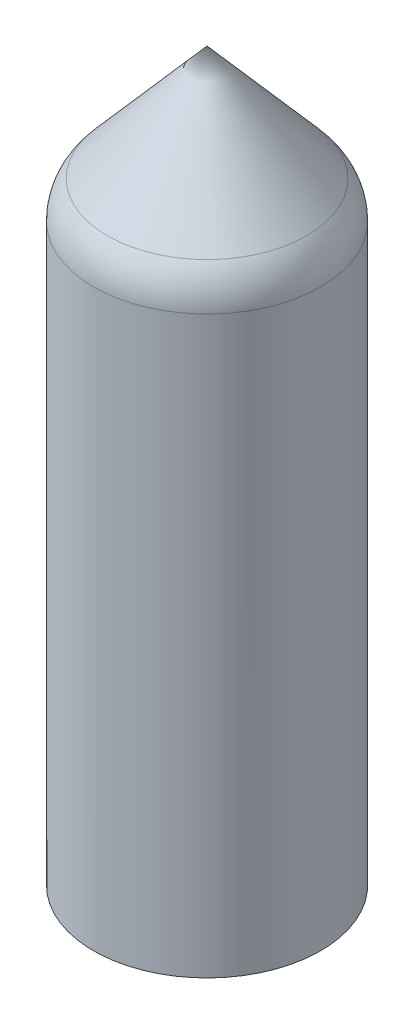
ISO-10303-21;
HEADER;
FILE_DESCRIPTION(('STEP AP214'),'2;1');
FILE_NAME('part.step','',(''),(''),'','','');
FILE_SCHEMA(('AUTOMOTIVE_DESIGN { 1 0 10303 214 1 1 1 1 }'));
ENDSEC;
DATA;
#1=APPLICATION_CONTEXT('core data for automotive mechanical design processes');
#2=APPLICATION_PROTOCOL_DEFINITION('international standard','automotive_design',2000,#1);
#3=PRODUCT_CONTEXT('',#1,'mechanical');
#4=PRODUCT('Part','Part','',(#3));
#5=PRODUCT_RELATED_PRODUCT_CATEGORY('part','',(#4));
#6=PRODUCT_DEFINITION_FORMATION('','',#4);
#7=PRODUCT_DEFINITION_CONTEXT('part definition',#1,'design');
#8=PRODUCT_DEFINITION('design','',#6,#7);
#9=PRODUCT_DEFINITION_SHAPE('','',#8);
#10=(LENGTH_UNIT() NAMED_UNIT(*) SI_UNIT(.MILLI.,.METRE.));
#11=(NAMED_UNIT(*) PLANE_ANGLE_UNIT() SI_UNIT($,.RADIAN.));
#12=(NAMED_UNIT(*) SI_UNIT($,.STERADIAN.) SOLID_ANGLE_UNIT());
#13=UNCERTAINTY_MEASURE_WITH_UNIT(LENGTH_MEASURE(1.E-05),#10,'distance_accuracy_value','');
#14=(GEOMETRIC_REPRESENTATION_CONTEXT(3) GLOBAL_UNCERTAINTY_ASSIGNED_CONTEXT((#13)) GLOBAL_UNIT_ASSIGNED_CONTEXT((#10,
#11,#12)) REPRESENTATION_CONTEXT('',''));
#15=CARTESIAN_POINT('',(0.,0.,0.));
#16=DIRECTION('',(0.,0.,1.));
#17=DIRECTION('',(1.,0.,0.));
#18=AXIS2_PLACEMENT_3D('',#15,#16,#17);
#19=CARTESIAN_POINT('',(-12.5,0.,0.));
#20=DIRECTION('',(0.,-1.,0.));
#21=DIRECTION('',(0.,0.,-1.));
#22=AXIS2_PLACEMENT_3D('',#19,#20,#21);
#23=CYLINDRICAL_SURFACE('',#22,1.65);
#24=CARTESIAN_POINT('',(-12.5,-5.,0.));
#25=DIRECTION('',(0.,-1.,0.));
#26=DIRECTION('',(0.,0.,1.));
#27=AXIS2_PLACEMENT_3D('',#24,#25,#26);
#28=CIRCLE('',#27,1.65);
#29=CARTESIAN_POINT('',(-12.5,-5.,1.65));
#30=VERTEX_POINT('',#29);
#31=EDGE_CURVE('E211',#30,#30,#28,.T.);
#32=ORIENTED_EDGE('',*,*,#31,.T.);
#33=EDGE_LOOP('',(#32));
#34=FACE_BOUND('',#33,.T.);
#35=CARTESIAN_POINT('',(-12.5,-2.,0.));
#36=DIRECTION('',(0.,1.,0.));
#37=DIRECTION('',(0.,0.,1.));
#38=AXIS2_PLACEMENT_3D('',#35,#36,#37);
#39=CIRCLE('',#38,1.65);
#40=CARTESIAN_POINT('',(-12.5,-2.,1.65));
#41=VERTEX_POINT('',#40);
#42=EDGE_CURVE('E209',#41,#41,#39,.F.);
#43=ORIENTED_EDGE('',*,*,#42,.F.);
#44=EDGE_LOOP('',(#43));
#45=FACE_BOUND('',#44,.T.);
#46=ADVANCED_FACE('F32',(#34,#45),#23,.F.);
#47=CARTESIAN_POINT('',(12.5,0.,0.));
#48=DIRECTION('',(0.,-1.,0.));
#49=DIRECTION('',(0.,0.,-1.));
#50=AXIS2_PLACEMENT_3D('',#47,#48,#49);
#51=CYLINDRICAL_SURFACE('',#50,1.65);
#52=CARTESIAN_POINT('',(12.5,-5.,0.));
#53=DIRECTION('',(0.,-1.,0.));
#54=DIRECTION('',(0.,0.,-1.));
#55=AXIS2_PLACEMENT_3D('',#52,#53,#54);
#56=CIRCLE('',#55,1.65);
#57=CARTESIAN_POINT('',(12.5,-5.,-1.65));
#58=VERTEX_POINT('',#57);
#59=EDGE_CURVE('E212',#58,#58,#56,.T.);
#60=ORIENTED_EDGE('',*,*,#59,.T.);
#61=EDGE_LOOP('',(#60));
#62=FACE_BOUND('',#61,.T.);
#63=CARTESIAN_POINT('',(12.5,-2.,0.));
#64=DIRECTION('',(0.,1.,0.));
#65=DIRECTION('',(0.,0.,1.));
#66=AXIS2_PLACEMENT_3D('',#63,#64,#65);
#67=CIRCLE('',#66,1.65);
#68=CARTESIAN_POINT('',(12.5,-2.,1.65));
#69=VERTEX_POINT('',#68);
#70=EDGE_CURVE('E171',#69,#69,#67,.F.);
#71=ORIENTED_EDGE('',*,*,#70,.F.);
#72=EDGE_LOOP('',(#71));
#73=FACE_BOUND('',#72,.T.);
#74=ADVANCED_FACE('F300',(#62,#73),#51,.F.);
#75=CARTESIAN_POINT('',(0.,100.,0.));
#76=DIRECTION('',(0.,-1.,0.));
#77=DIRECTION('',(0.,0.,-1.));
#78=AXIS2_PLACEMENT_3D('',#75,#76,#77);
#79=CONICAL_SURFACE('',#78,17.,0.704494064242218);
#80=CARTESIAN_POINT('',(0.,120.,0.));
#81=VERTEX_POINT('',#80);
#82=VERTEX_LOOP('',#81);
#83=FACE_BOUND('',#82,.T.);
#84=CARTESIAN_POINT('',(0.,100.,0.));
#85=DIRECTION('',(0.,-1.,0.));
#86=DIRECTION('',(0.,0.,-1.));
#87=AXIS2_PLACEMENT_3D('',#84,#85,#86);
#88=CIRCLE('',#87,17.);
#89=CARTESIAN_POINT('',(0.,100.,-17.));
#90=VERTEX_POINT('',#89);
#91=EDGE_CURVE('E230',#90,#90,#88,.T.);
#92=ORIENTED_EDGE('',*,*,#91,.T.);
#93=EDGE_LOOP('',(#92));
#94=FACE_BOUND('',#93,.T.);
#95=ADVANCED_FACE('F306',(#83,#94),#79,.F.);
#96=CARTESIAN_POINT('',(0.,0.,0.));
#97=DIRECTION('',(0.,-1.,0.));
#98=DIRECTION('',(0.,0.,-1.));
#99=AXIS2_PLACEMENT_3D('',#96,#97,#98);
#100=CYLINDRICAL_SURFACE('',#99,17.);
#101=ORIENTED_EDGE('',*,*,#91,.F.);
#102=EDGE_LOOP('',(#101));
#103=FACE_BOUND('',#102,.T.);
#104=CARTESIAN_POINT('',(0.,0.,0.));
#105=DIRECTION('',(0.,-1.,0.));
#106=DIRECTION('',(0.,0.,-1.));
#107=AXIS2_PLACEMENT_3D('',#104,#105,#106);
#108=CIRCLE('',#107,17.);
#109=CARTESIAN_POINT('',(0.,0.,-17.));
#110=VERTEX_POINT('',#109);
#111=EDGE_CURVE('E227',#110,#110,#108,.T.);
#112=ORIENTED_EDGE('',*,*,#111,.T.);
#113=EDGE_LOOP('',(#112));
#114=FACE_BOUND('',#113,.T.);
#115=ADVANCED_FACE('F328',(#103,#114),#100,.F.);
#116=CARTESIAN_POINT('',(-10.,0.,0.));
#117=DIRECTION('',(0.,-1.,0.));
#118=DIRECTION('',(0.,0.,-1.));
#119=AXIS2_PLACEMENT_3D('',#116,#117,#118);
#120=PLANE('',#119);
#121=ORIENTED_EDGE('',*,*,#111,.F.);
#122=EDGE_LOOP('',(#121));
#123=FACE_BOUND('',#122,.T.);
#124=DIRECTION('',(-0.866025403784439,0.,0.5));
#125=VECTOR('',#124,1.);
#126=CARTESIAN_POINT('',(-12.5,0.,-3.4));
#127=LINE('',#126,#125);
#128=CARTESIAN_POINT('',(-12.5,0.,-3.4));
#129=VERTEX_POINT('',#128);
#130=CARTESIAN_POINT('',(-15.4444863728671,0.,-1.7));
#131=VERTEX_POINT('',#130);
#132=EDGE_CURVE('E159',#129,#131,#127,.T.);
#133=ORIENTED_EDGE('',*,*,#132,.F.);
#134=DIRECTION('',(-0.866025403784439,0.,-0.5));
#135=VECTOR('',#134,1.);
#136=CARTESIAN_POINT('',(-9.55551362713291,0.,-1.7));
#137=LINE('',#136,#135);
#138=CARTESIAN_POINT('',(-9.82620068659996,0.,-1.85628124664945));
#139=VERTEX_POINT('',#138);
#140=EDGE_CURVE('E143',#139,#129,#137,.T.);
#141=ORIENTED_EDGE('',*,*,#140,.F.);
#142=CARTESIAN_POINT('',(0.,0.,0.));
#143=DIRECTION('',(0.,-1.,0.));
#144=DIRECTION('',(0.,0.,-1.));
#145=AXIS2_PLACEMENT_3D('',#142,#143,#144);
#146=CIRCLE('',#145,10.);
#147=CARTESIAN_POINT('',(9.82620068659996,0.,-1.85628124664945));
#148=VERTEX_POINT('',#147);
#149=EDGE_CURVE('E223',#139,#148,#146,.T.);
#150=ORIENTED_EDGE('',*,*,#149,.T.);
#151=DIRECTION('',(-0.866025403784439,0.,0.5));
#152=VECTOR('',#151,1.);
#153=CARTESIAN_POINT('',(12.5,0.,-3.4));
#154=LINE('',#153,#152);
#155=CARTESIAN_POINT('',(12.5,0.,-3.4));
#156=VERTEX_POINT('',#155);
#157=EDGE_CURVE('E191',#156,#148,#154,.T.);
#158=ORIENTED_EDGE('',*,*,#157,.F.);
#159=DIRECTION('',(-0.866025403784439,0.,-0.5));
#160=VECTOR('',#159,1.);
#161=CARTESIAN_POINT('',(15.4444863728671,0.,-1.7));
#162=LINE('',#161,#160);
#163=CARTESIAN_POINT('',(15.4444863728671,0.,-1.7));
#164=VERTEX_POINT('',#163);
#165=EDGE_CURVE('E188',#164,#156,#162,.T.);
#166=ORIENTED_EDGE('',*,*,#165,.F.);
#167=DIRECTION('',(0.,0.,-1.));
#168=VECTOR('',#167,1.);
#169=CARTESIAN_POINT('',(15.4444863728671,0.,1.7));
#170=LINE('',#169,#168);
#171=CARTESIAN_POINT('',(15.4444863728671,0.,1.7));
#172=VERTEX_POINT('',#171);
#173=EDGE_CURVE('E177',#172,#164,#170,.T.);
#174=ORIENTED_EDGE('',*,*,#173,.F.);
#175=DIRECTION('',(0.866025403784439,0.,-0.5));
#176=VECTOR('',#175,1.);
#177=CARTESIAN_POINT('',(12.5,0.,3.4));
#178=LINE('',#177,#176);
#179=CARTESIAN_POINT('',(12.5,0.,3.4));
#180=VERTEX_POINT('',#179);
#181=EDGE_CURVE('E195',#180,#172,#178,.T.);
#182=ORIENTED_EDGE('',*,*,#181,.F.);
#183=DIRECTION('',(0.866025403784439,0.,0.5));
#184=VECTOR('',#183,1.);
#185=CARTESIAN_POINT('',(9.55551362713291,0.,1.7));
#186=LINE('',#185,#184);
#187=CARTESIAN_POINT('',(9.82620068659996,0.,1.85628124664945));
#188=VERTEX_POINT('',#187);
#189=EDGE_CURVE('E193',#188,#180,#186,.T.);
#190=ORIENTED_EDGE('',*,*,#189,.F.);
#191=CARTESIAN_POINT('',(-9.82620068659996,0.,1.85628124664945));
#192=VERTEX_POINT('',#191);
#193=EDGE_CURVE('E226',#188,#192,#146,.T.);
#194=ORIENTED_EDGE('',*,*,#193,.T.);
#195=DIRECTION('',(0.866025403784439,0.,-0.5));
#196=VECTOR('',#195,1.);
#197=CARTESIAN_POINT('',(-12.5,0.,3.4));
#198=LINE('',#197,#196);
#199=CARTESIAN_POINT('',(-12.5,0.,3.4));
#200=VERTEX_POINT('',#199);
#201=EDGE_CURVE('E137',#200,#192,#198,.T.);
#202=ORIENTED_EDGE('',*,*,#201,.F.);
#203=DIRECTION('',(0.866025403784439,0.,0.5));
#204=VECTOR('',#203,1.);
#205=CARTESIAN_POINT('',(-15.4444863728671,0.,1.7));
#206=LINE('',#205,#204);
#207=CARTESIAN_POINT('',(-15.4444863728671,0.,1.7));
#208=VERTEX_POINT('',#207);
#209=EDGE_CURVE('E165',#208,#200,#206,.T.);
#210=ORIENTED_EDGE('',*,*,#209,.F.);
#211=DIRECTION('',(0.,0.,1.));
#212=VECTOR('',#211,1.);
#213=CARTESIAN_POINT('',(-15.4444863728671,0.,-1.7));
#214=LINE('',#213,#212);
#215=EDGE_CURVE('E162',#131,#208,#214,.T.);
#216=ORIENTED_EDGE('',*,*,#215,.F.);
#217=EDGE_LOOP('',(#133,#141,#150,#158,#166,#174,#182,#190,#194,#202,#210,#216));
#218=FACE_BOUND('',#217,.T.);
#219=ADVANCED_FACE('F259',(#123,#218),#120,.F.);
#220=CARTESIAN_POINT('',(0.,0.,0.));
#221=DIRECTION('',(0.,-1.,0.));
#222=DIRECTION('',(0.,0.,-1.));
#223=AXIS2_PLACEMENT_3D('',#220,#221,#222);
#224=CYLINDRICAL_SURFACE('',#223,10.);
#225=ORIENTED_EDGE('',*,*,#149,.F.);
#226=DIRECTION('',(0.,-1.,0.));
#227=VECTOR('',#226,1.);
#228=CARTESIAN_POINT('',(-9.82620068659996,0.,-1.85628124664945));
#229=LINE('',#228,#227);
#230=CARTESIAN_POINT('',(-9.82620068659996,-2.,-1.85628124664945));
#231=VERTEX_POINT('',#230);
#232=EDGE_CURVE('E11',#139,#231,#229,.T.);
#233=ORIENTED_EDGE('',*,*,#232,.T.);
#234=CARTESIAN_POINT('',(0.,-2.,0.));
#235=DIRECTION('',(0.,1.,0.));
#236=DIRECTION('',(0.,0.,1.));
#237=AXIS2_PLACEMENT_3D('',#234,#235,#236);
#238=CIRCLE('',#237,10.);
#239=CARTESIAN_POINT('',(-9.82620068659996,-2.,1.85628124664945));
#240=VERTEX_POINT('',#239);
#241=EDGE_CURVE('E135',#240,#231,#238,.F.);
#242=ORIENTED_EDGE('',*,*,#241,.F.);
#243=DIRECTION('',(0.,-1.,0.));
#244=VECTOR('',#243,1.);
#245=CARTESIAN_POINT('',(-9.82620068659996,0.,1.85628124664945));
#246=LINE('',#245,#244);
#247=EDGE_CURVE('E40',#240,#192,#246,.F.);
#248=ORIENTED_EDGE('',*,*,#247,.T.);
#249=ORIENTED_EDGE('',*,*,#193,.F.);
#250=DIRECTION('',(0.,-1.,0.));
#251=VECTOR('',#250,1.);
#252=CARTESIAN_POINT('',(9.82620068659996,0.,1.85628124664945));
#253=LINE('',#252,#251);
#254=CARTESIAN_POINT('',(9.82620068659996,-2.,1.85628124664945));
#255=VERTEX_POINT('',#254);
#256=EDGE_CURVE('E246',#188,#255,#253,.T.);
#257=ORIENTED_EDGE('',*,*,#256,.T.);
#258=CARTESIAN_POINT('',(0.,-2.,0.));
#259=DIRECTION('',(0.,1.,0.));
#260=DIRECTION('',(0.,0.,1.));
#261=AXIS2_PLACEMENT_3D('',#258,#259,#260);
#262=CIRCLE('',#261,10.);
#263=CARTESIAN_POINT('',(9.82620068659996,-2.,-1.85628124664945));
#264=VERTEX_POINT('',#263);
#265=EDGE_CURVE('E207',#264,#255,#262,.F.);
#266=ORIENTED_EDGE('',*,*,#265,.F.);
#267=DIRECTION('',(0.,-1.,0.));
#268=VECTOR('',#267,1.);
#269=CARTESIAN_POINT('',(9.82620068659996,0.,-1.85628124664945));
#270=LINE('',#269,#268);
#271=EDGE_CURVE('E239',#264,#148,#270,.F.);
#272=ORIENTED_EDGE('',*,*,#271,.T.);
#273=EDGE_LOOP('',(#225,#233,#242,#248,#249,#257,#266,#272));
#274=FACE_BOUND('',#273,.T.);
#275=CARTESIAN_POINT('',(0.,-5.,0.));
#276=DIRECTION('',(0.,-1.,0.));
#277=DIRECTION('',(0.,0.,-1.));
#278=AXIS2_PLACEMENT_3D('',#275,#276,#277);
#279=CIRCLE('',#278,10.);
#280=CARTESIAN_POINT('',(0.,-5.,-10.));
#281=VERTEX_POINT('',#280);
#282=EDGE_CURVE('E220',#281,#281,#279,.T.);
#283=ORIENTED_EDGE('',*,*,#282,.T.);
#284=EDGE_LOOP('',(#283));
#285=FACE_BOUND('',#284,.T.);
#286=ADVANCED_FACE('F253',(#274,#285),#224,.F.);
#287=CARTESIAN_POINT('',(-20.,-5.,0.));
#288=DIRECTION('',(0.,1.,0.));
#289=DIRECTION('',(0.,0.,1.));
#290=AXIS2_PLACEMENT_3D('',#287,#288,#289);
#291=PLANE('',#290);
#292=ORIENTED_EDGE('',*,*,#59,.F.);
#293=EDGE_LOOP('',(#292));
#294=FACE_BOUND('',#293,.T.);
#295=ORIENTED_EDGE('',*,*,#31,.F.);
#296=EDGE_LOOP('',(#295));
#297=FACE_BOUND('',#296,.T.);
#298=ORIENTED_EDGE('',*,*,#282,.F.);
#299=EDGE_LOOP('',(#298));
#300=FACE_BOUND('',#299,.T.);
#301=CARTESIAN_POINT('',(0.,-5.,0.));
#302=DIRECTION('',(0.,-1.,0.));
#303=DIRECTION('',(0.,0.,-1.));
#304=AXIS2_PLACEMENT_3D('',#301,#302,#303);
#305=CIRCLE('',#304,20.);
#306=CARTESIAN_POINT('',(0.,-5.,-20.));
#307=VERTEX_POINT('',#306);
#308=EDGE_CURVE('E215',#307,#307,#305,.T.);
#309=ORIENTED_EDGE('',*,*,#308,.T.);
#310=EDGE_LOOP('',(#309));
#311=FACE_BOUND('',#310,.T.);
#312=ADVANCED_FACE('F319',(#294,#297,#300,#311),#291,.F.);
#313=CARTESIAN_POINT('',(0.,0.,0.));
#314=DIRECTION('',(0.,-1.,0.));
#315=DIRECTION('',(0.,0.,-1.));
#316=AXIS2_PLACEMENT_3D('',#313,#314,#315);
#317=CYLINDRICAL_SURFACE('',#316,20.);
#318=CARTESIAN_POINT('',(0.,96.2602493458718,0.));
#319=DIRECTION('',(0.,1.,0.));
#320=DIRECTION('',(0.,0.,1.));
#321=AXIS2_PLACEMENT_3D('',#318,#319,#320);
#322=CIRCLE('',#321,20.);
#323=CARTESIAN_POINT('',(0.,96.2602493458718,20.));
#324=VERTEX_POINT('',#323);
#325=EDGE_CURVE('E233',#324,#324,#322,.F.);
#326=ORIENTED_EDGE('',*,*,#325,.T.);
#327=EDGE_LOOP('',(#326));
#328=FACE_BOUND('',#327,.T.);
#329=ORIENTED_EDGE('',*,*,#308,.F.);
#330=EDGE_LOOP('',(#329));
#331=FACE_BOUND('',#330,.T.);
#332=ADVANCED_FACE('F315',(#328,#331),#317,.T.);
#333=CARTESIAN_POINT('',(0.,123.,0.));
#334=DIRECTION('',(0.,-1.,0.));
#335=DIRECTION('',(0.,0.,-1.));
#336=AXIS2_PLACEMENT_3D('',#333,#334,#335);
#337=CONICAL_SURFACE('',#336,0.,0.71574358966888);
#338=CARTESIAN_POINT('',(0.,102.82203649512,0.));
#339=DIRECTION('',(0.,1.,0.));
#340=DIRECTION('',(0.,0.,1.));
#341=AXIS2_PLACEMENT_3D('',#338,#339,#340);
#342=CIRCLE('',#341,17.546055221635);
#343=CARTESIAN_POINT('',(0.,102.82203649512,17.546055221635));
#344=VERTEX_POINT('',#343);
#345=EDGE_CURVE('E236',#344,#344,#342,.T.);
#346=ORIENTED_EDGE('',*,*,#345,.T.);
#347=EDGE_LOOP('',(#346));
#348=FACE_BOUND('',#347,.T.);
#349=CARTESIAN_POINT('',(0.,123.,0.));
#350=VERTEX_POINT('',#349);
#351=VERTEX_LOOP('',#350);
#352=FACE_BOUND('',#351,.T.);
#353=ADVANCED_FACE('F312',(#348,#352),#337,.T.);
#354=CARTESIAN_POINT('',(0.,96.2602493458718,0.));
#355=DIRECTION('',(0.,1.,0.));
#356=DIRECTION('',(0.,0.,1.));
#357=AXIS2_PLACEMENT_3D('',#354,#355,#356);
#358=DEGENERATE_TOROIDAL_SURFACE('',#357,10.,10.,.T.);
#359=ORIENTED_EDGE('',*,*,#345,.F.);
#360=EDGE_LOOP('',(#359));
#361=FACE_BOUND('',#360,.T.);
#362=ORIENTED_EDGE('',*,*,#325,.F.);
#363=EDGE_LOOP('',(#362));
#364=FACE_BOUND('',#363,.T.);
#365=ADVANCED_FACE('F34',(#361,#364),#358,.T.);
#366=CARTESIAN_POINT('',(9.55551362713291,-2.,1.7));
#367=DIRECTION('',(-0.5,0.,0.866025403784439));
#368=DIRECTION('',(0.866025403784439,0.,0.5));
#369=AXIS2_PLACEMENT_3D('',#366,#367,#368);
#370=PLANE('',#369);
#371=ORIENTED_EDGE('',*,*,#189,.T.);
#372=DIRECTION('',(0.,1.,0.));
#373=VECTOR('',#372,1.);
#374=CARTESIAN_POINT('',(12.5,-2.,3.4));
#375=LINE('',#374,#373);
#376=CARTESIAN_POINT('',(12.5,-2.,3.4));
#377=VERTEX_POINT('',#376);
#378=EDGE_CURVE('E203',#377,#180,#375,.T.);
#379=ORIENTED_EDGE('',*,*,#378,.F.);
#380=DIRECTION('',(0.866025403784439,0.,0.5));
#381=VECTOR('',#380,1.);
#382=CARTESIAN_POINT('',(9.55551362713291,-2.,1.7));
#383=LINE('',#382,#381);
#384=EDGE_CURVE('E179',#255,#377,#383,.T.);
#385=ORIENTED_EDGE('',*,*,#384,.F.);
#386=ORIENTED_EDGE('',*,*,#256,.F.);
#387=EDGE_LOOP('',(#371,#379,#385,#386));
#388=FACE_BOUND('',#387,.T.);
#389=ADVANCED_FACE('F265',(#388),#370,.F.);
#390=CARTESIAN_POINT('',(12.5,-2.,-3.4));
#391=DIRECTION('',(-0.5,0.,-0.866025403784439));
#392=DIRECTION('',(-0.866025403784439,0.,0.5));
#393=AXIS2_PLACEMENT_3D('',#390,#391,#392);
#394=PLANE('',#393);
#395=DIRECTION('',(-0.866025403784439,0.,0.5));
#396=VECTOR('',#395,1.);
#397=CARTESIAN_POINT('',(12.5,-2.,-3.4));
#398=LINE('',#397,#396);
#399=CARTESIAN_POINT('',(12.5,-2.,-3.4));
#400=VERTEX_POINT('',#399);
#401=EDGE_CURVE('E55',#400,#264,#398,.T.);
#402=ORIENTED_EDGE('',*,*,#401,.F.);
#403=DIRECTION('',(0.,1.,0.));
#404=VECTOR('',#403,1.);
#405=CARTESIAN_POINT('',(12.5,-2.,-3.4));
#406=LINE('',#405,#404);
#407=EDGE_CURVE('E187',#400,#156,#406,.T.);
#408=ORIENTED_EDGE('',*,*,#407,.T.);
#409=ORIENTED_EDGE('',*,*,#157,.T.);
#410=ORIENTED_EDGE('',*,*,#271,.F.);
#411=EDGE_LOOP('',(#402,#408,#409,#410));
#412=FACE_BOUND('',#411,.T.);
#413=ADVANCED_FACE('F280',(#412),#394,.F.);
#414=CARTESIAN_POINT('',(0.,-2.,0.));
#415=DIRECTION('',(0.,1.,0.));
#416=DIRECTION('',(0.,0.,1.));
#417=AXIS2_PLACEMENT_3D('',#414,#415,#416);
#418=PLANE('',#417);
#419=ORIENTED_EDGE('',*,*,#70,.T.);
#420=EDGE_LOOP('',(#419));
#421=FACE_BOUND('',#420,.T.);
#422=ORIENTED_EDGE('',*,*,#265,.T.);
#423=ORIENTED_EDGE('',*,*,#384,.T.);
#424=DIRECTION('',(0.866025403784439,0.,-0.5));
#425=VECTOR('',#424,1.);
#426=CARTESIAN_POINT('',(12.5,-2.,3.4));
#427=LINE('',#426,#425);
#428=CARTESIAN_POINT('',(15.4444863728671,-2.,1.7));
#429=VERTEX_POINT('',#428);
#430=EDGE_CURVE('E181',#377,#429,#427,.T.);
#431=ORIENTED_EDGE('',*,*,#430,.T.);
#432=DIRECTION('',(0.,0.,-1.));
#433=VECTOR('',#432,1.);
#434=CARTESIAN_POINT('',(15.4444863728671,-2.,1.7));
#435=LINE('',#434,#433);
#436=CARTESIAN_POINT('',(15.4444863728671,-2.,-1.7));
#437=VERTEX_POINT('',#436);
#438=EDGE_CURVE('E184',#429,#437,#435,.T.);
#439=ORIENTED_EDGE('',*,*,#438,.T.);
#440=DIRECTION('',(-0.866025403784439,0.,-0.5));
#441=VECTOR('',#440,1.);
#442=CARTESIAN_POINT('',(15.4444863728671,-2.,-1.7));
#443=LINE('',#442,#441);
#444=EDGE_CURVE('E175',#437,#400,#443,.T.);
#445=ORIENTED_EDGE('',*,*,#444,.T.);
#446=ORIENTED_EDGE('',*,*,#401,.T.);
#447=EDGE_LOOP('',(#422,#423,#431,#439,#445,#446));
#448=FACE_BOUND('',#447,.T.);
#449=ADVANCED_FACE('F271',(#421,#448),#418,.T.);
#450=CARTESIAN_POINT('',(15.4444863728671,-2.,-1.7));
#451=DIRECTION('',(0.5,0.,-0.866025403784439));
#452=DIRECTION('',(-0.866025403784439,0.,-0.5));
#453=AXIS2_PLACEMENT_3D('',#450,#451,#452);
#454=PLANE('',#453);
#455=ORIENTED_EDGE('',*,*,#165,.T.);
#456=ORIENTED_EDGE('',*,*,#407,.F.);
#457=ORIENTED_EDGE('',*,*,#444,.F.);
#458=DIRECTION('',(0.,1.,0.));
#459=VECTOR('',#458,1.);
#460=CARTESIAN_POINT('',(15.4444863728671,-2.,-1.7));
#461=LINE('',#460,#459);
#462=EDGE_CURVE('E160',#437,#164,#461,.T.);
#463=ORIENTED_EDGE('',*,*,#462,.T.);
#464=EDGE_LOOP('',(#455,#456,#457,#463));
#465=FACE_BOUND('',#464,.T.);
#466=ADVANCED_FACE('F277',(#465),#454,.F.);
#467=CARTESIAN_POINT('',(15.4444863728671,-2.,1.7));
#468=DIRECTION('',(1.,0.,0.));
#469=DIRECTION('',(0.,0.,-1.));
#470=AXIS2_PLACEMENT_3D('',#467,#468,#469);
#471=PLANE('',#470);
#472=ORIENTED_EDGE('',*,*,#173,.T.);
#473=ORIENTED_EDGE('',*,*,#462,.F.);
#474=ORIENTED_EDGE('',*,*,#438,.F.);
#475=DIRECTION('',(0.,1.,0.));
#476=VECTOR('',#475,1.);
#477=CARTESIAN_POINT('',(15.4444863728671,-2.,1.7));
#478=LINE('',#477,#476);
#479=EDGE_CURVE('E201',#429,#172,#478,.T.);
#480=ORIENTED_EDGE('',*,*,#479,.T.);
#481=EDGE_LOOP('',(#472,#473,#474,#480));
#482=FACE_BOUND('',#481,.T.);
#483=ADVANCED_FACE('F273',(#482),#471,.F.);
#484=CARTESIAN_POINT('',(12.5,-2.,3.4));
#485=DIRECTION('',(0.5,0.,0.866025403784439));
#486=DIRECTION('',(0.866025403784439,0.,-0.5));
#487=AXIS2_PLACEMENT_3D('',#484,#485,#486);
#488=PLANE('',#487);
#489=ORIENTED_EDGE('',*,*,#181,.T.);
#490=ORIENTED_EDGE('',*,*,#479,.F.);
#491=ORIENTED_EDGE('',*,*,#430,.F.);
#492=ORIENTED_EDGE('',*,*,#378,.T.);
#493=EDGE_LOOP('',(#489,#490,#491,#492));
#494=FACE_BOUND('',#493,.T.);
#495=ADVANCED_FACE('F269',(#494),#488,.F.);
#496=CARTESIAN_POINT('',(-9.55551362713291,-2.,-1.7));
#497=DIRECTION('',(0.5,0.,-0.866025403784439));
#498=DIRECTION('',(-0.866025403784439,0.,-0.5));
#499=AXIS2_PLACEMENT_3D('',#496,#497,#498);
#500=PLANE('',#499);
#501=ORIENTED_EDGE('',*,*,#140,.T.);
#502=DIRECTION('',(0.,1.,0.));
#503=VECTOR('',#502,1.);
#504=CARTESIAN_POINT('',(-12.5,-2.,-3.4));
#505=LINE('',#504,#503);
#506=CARTESIAN_POINT('',(-12.5,-2.,-3.4));
#507=VERTEX_POINT('',#506);
#508=EDGE_CURVE('E140',#507,#129,#505,.T.);
#509=ORIENTED_EDGE('',*,*,#508,.F.);
#510=DIRECTION('',(-0.866025403784439,0.,-0.5));
#511=VECTOR('',#510,1.);
#512=CARTESIAN_POINT('',(-9.55551362713291,-2.,-1.7));
#513=LINE('',#512,#511);
#514=EDGE_CURVE('E128',#231,#507,#513,.T.);
#515=ORIENTED_EDGE('',*,*,#514,.F.);
#516=ORIENTED_EDGE('',*,*,#232,.F.);
#517=EDGE_LOOP('',(#501,#509,#515,#516));
#518=FACE_BOUND('',#517,.T.);
#519=ADVANCED_FACE('F141',(#518),#500,.F.);
#520=CARTESIAN_POINT('',(-12.5,-2.,3.4));
#521=DIRECTION('',(0.5,0.,0.866025403784439));
#522=DIRECTION('',(0.866025403784439,0.,-0.5));
#523=AXIS2_PLACEMENT_3D('',#520,#521,#522);
#524=PLANE('',#523);
#525=DIRECTION('',(0.866025403784439,0.,-0.5));
#526=VECTOR('',#525,1.);
#527=CARTESIAN_POINT('',(-12.5,-2.,3.4));
#528=LINE('',#527,#526);
#529=CARTESIAN_POINT('',(-12.5,-2.,3.4));
#530=VERTEX_POINT('',#529);
#531=EDGE_CURVE('E47',#530,#240,#528,.T.);
#532=ORIENTED_EDGE('',*,*,#531,.F.);
#533=DIRECTION('',(0.,1.,0.));
#534=VECTOR('',#533,1.);
#535=CARTESIAN_POINT('',(-12.5,-2.,3.4));
#536=LINE('',#535,#534);
#537=EDGE_CURVE('E169',#530,#200,#536,.T.);
#538=ORIENTED_EDGE('',*,*,#537,.T.);
#539=ORIENTED_EDGE('',*,*,#201,.T.);
#540=ORIENTED_EDGE('',*,*,#247,.F.);
#541=EDGE_LOOP('',(#532,#538,#539,#540));
#542=FACE_BOUND('',#541,.T.);
#543=ADVANCED_FACE('F288',(#542),#524,.F.);
#544=CARTESIAN_POINT('',(0.,-2.,0.));
#545=DIRECTION('',(0.,1.,0.));
#546=DIRECTION('',(0.,0.,1.));
#547=AXIS2_PLACEMENT_3D('',#544,#545,#546);
#548=PLANE('',#547);
#549=ORIENTED_EDGE('',*,*,#42,.T.);
#550=EDGE_LOOP('',(#549));
#551=FACE_BOUND('',#550,.T.);
#552=ORIENTED_EDGE('',*,*,#241,.T.);
#553=ORIENTED_EDGE('',*,*,#514,.T.);
#554=DIRECTION('',(-0.866025403784439,0.,0.5));
#555=VECTOR('',#554,1.);
#556=CARTESIAN_POINT('',(-12.5,-2.,-3.4));
#557=LINE('',#556,#555);
#558=CARTESIAN_POINT('',(-15.4444863728671,-2.,-1.7));
#559=VERTEX_POINT('',#558);
#560=EDGE_CURVE('E133',#507,#559,#557,.T.);
#561=ORIENTED_EDGE('',*,*,#560,.T.);
#562=DIRECTION('',(0.,0.,1.));
#563=VECTOR('',#562,1.);
#564=CARTESIAN_POINT('',(-15.4444863728671,-2.,-1.7));
#565=LINE('',#564,#563);
#566=CARTESIAN_POINT('',(-15.4444863728671,-2.,1.7));
#567=VERTEX_POINT('',#566);
#568=EDGE_CURVE('E151',#559,#567,#565,.T.);
#569=ORIENTED_EDGE('',*,*,#568,.T.);
#570=DIRECTION('',(0.866025403784439,0.,0.5));
#571=VECTOR('',#570,1.);
#572=CARTESIAN_POINT('',(-15.4444863728671,-2.,1.7));
#573=LINE('',#572,#571);
#574=EDGE_CURVE('E153',#567,#530,#573,.T.);
#575=ORIENTED_EDGE('',*,*,#574,.T.);
#576=ORIENTED_EDGE('',*,*,#531,.T.);
#577=EDGE_LOOP('',(#552,#553,#561,#569,#575,#576));
#578=FACE_BOUND('',#577,.T.);
#579=ADVANCED_FACE('F130',(#551,#578),#548,.T.);
#580=CARTESIAN_POINT('',(-15.4444863728671,-2.,1.7));
#581=DIRECTION('',(-0.5,0.,0.866025403784439));
#582=DIRECTION('',(0.866025403784439,0.,0.5));
#583=AXIS2_PLACEMENT_3D('',#580,#581,#582);
#584=PLANE('',#583);
#585=ORIENTED_EDGE('',*,*,#209,.T.);
#586=ORIENTED_EDGE('',*,*,#537,.F.);
#587=ORIENTED_EDGE('',*,*,#574,.F.);
#588=DIRECTION('',(0.,1.,0.));
#589=VECTOR('',#588,1.);
#590=CARTESIAN_POINT('',(-15.4444863728671,-2.,1.7));
#591=LINE('',#590,#589);
#592=EDGE_CURVE('E172',#567,#208,#591,.T.);
#593=ORIENTED_EDGE('',*,*,#592,.T.);
#594=EDGE_LOOP('',(#585,#586,#587,#593));
#595=FACE_BOUND('',#594,.T.);
#596=ADVANCED_FACE('F287',(#595),#584,.F.);
#597=CARTESIAN_POINT('',(-15.4444863728671,-2.,-1.7));
#598=DIRECTION('',(-1.,0.,0.));
#599=DIRECTION('',(0.,0.,1.));
#600=AXIS2_PLACEMENT_3D('',#597,#598,#599);
#601=PLANE('',#600);
#602=ORIENTED_EDGE('',*,*,#215,.T.);
#603=ORIENTED_EDGE('',*,*,#592,.F.);
#604=ORIENTED_EDGE('',*,*,#568,.F.);
#605=DIRECTION('',(0.,1.,0.));
#606=VECTOR('',#605,1.);
#607=CARTESIAN_POINT('',(-15.4444863728671,-2.,-1.7));
#608=LINE('',#607,#606);
#609=EDGE_CURVE('E147',#559,#131,#608,.T.);
#610=ORIENTED_EDGE('',*,*,#609,.T.);
#611=EDGE_LOOP('',(#602,#603,#604,#610));
#612=FACE_BOUND('',#611,.T.);
#613=ADVANCED_FACE('F284',(#612),#601,.F.);
#614=CARTESIAN_POINT('',(-12.5,-2.,-3.4));
#615=DIRECTION('',(-0.5,0.,-0.866025403784439));
#616=DIRECTION('',(-0.866025403784439,0.,0.5));
#617=AXIS2_PLACEMENT_3D('',#614,#615,#616);
#618=PLANE('',#617);
#619=ORIENTED_EDGE('',*,*,#132,.T.);
#620=ORIENTED_EDGE('',*,*,#609,.F.);
#621=ORIENTED_EDGE('',*,*,#560,.F.);
#622=ORIENTED_EDGE('',*,*,#508,.T.);
#623=EDGE_LOOP('',(#619,#620,#621,#622));
#624=FACE_BOUND('',#623,.T.);
#625=ADVANCED_FACE('F149',(#624),#618,.F.);
#626=CLOSED_SHELL('',(#46,#74,#95,#115,#219,#286,#312,#332,#353,#365,#389,#413,#449,#466,#483,
#495,#519,#543,#579,#596,#613,#625));
#627=MANIFOLD_SOLID_BREP('B2',#626);
#628=ADVANCED_BREP_SHAPE_REPRESENTATION('',(#18,#627),#14);
#629=SHAPE_DEFINITION_REPRESENTATION(#9,#628);
ENDSEC;
END-ISO-10303-21;
